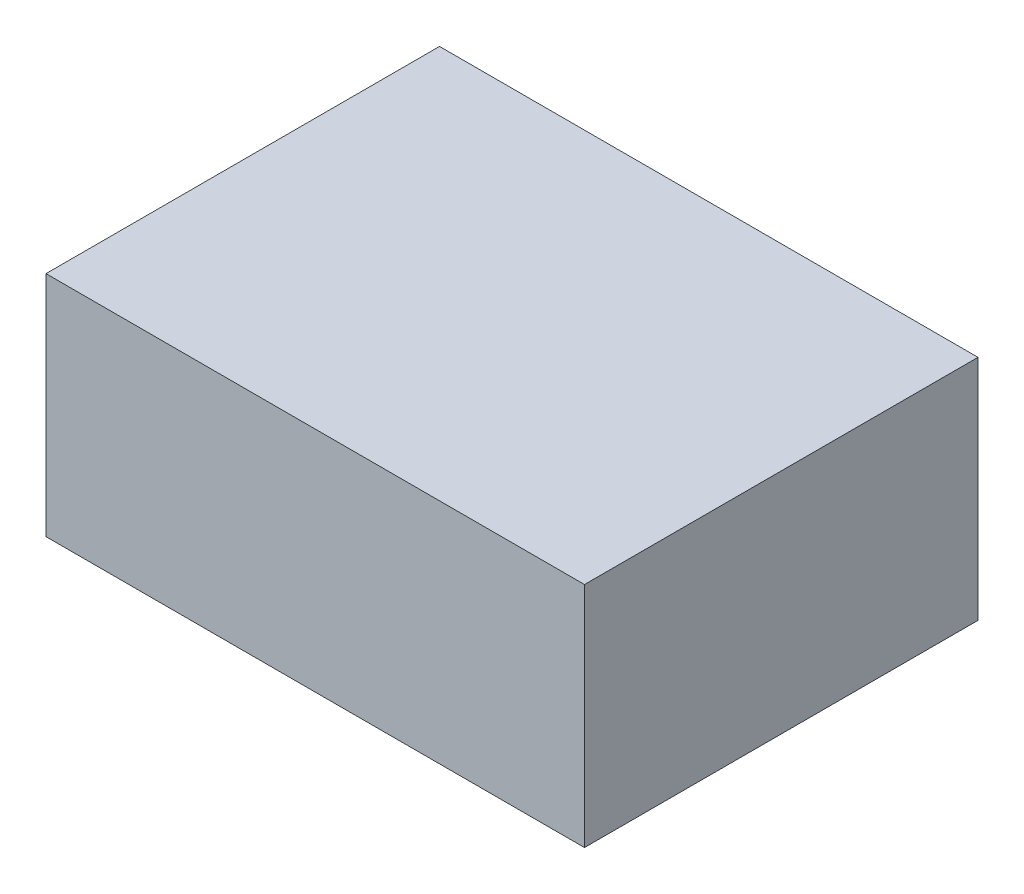
ISO-10303-21;
HEADER;
FILE_DESCRIPTION(('STEP AP214'),'2;1');
FILE_NAME('part.step','',(''),(''),'','','');
FILE_SCHEMA(('AUTOMOTIVE_DESIGN { 1 0 10303 214 1 1 1 1 }'));
ENDSEC;
DATA;
#1=APPLICATION_CONTEXT('core data for automotive mechanical design processes');
#2=APPLICATION_PROTOCOL_DEFINITION('international standard','automotive_design',2000,#1);
#3=PRODUCT_CONTEXT('',#1,'mechanical');
#4=PRODUCT('Part','Part','',(#3));
#5=PRODUCT_RELATED_PRODUCT_CATEGORY('part','',(#4));
#6=PRODUCT_DEFINITION_FORMATION('','',#4);
#7=PRODUCT_DEFINITION_CONTEXT('part definition',#1,'design');
#8=PRODUCT_DEFINITION('design','',#6,#7);
#9=PRODUCT_DEFINITION_SHAPE('','',#8);
#10=(LENGTH_UNIT() NAMED_UNIT(*) SI_UNIT(.MILLI.,.METRE.));
#11=(NAMED_UNIT(*) PLANE_ANGLE_UNIT() SI_UNIT($,.RADIAN.));
#12=(NAMED_UNIT(*) SI_UNIT($,.STERADIAN.) SOLID_ANGLE_UNIT());
#13=UNCERTAINTY_MEASURE_WITH_UNIT(LENGTH_MEASURE(1.E-05),#10,'distance_accuracy_value','');
#14=(GEOMETRIC_REPRESENTATION_CONTEXT(3) GLOBAL_UNCERTAINTY_ASSIGNED_CONTEXT((#13)) GLOBAL_UNIT_ASSIGNED_CONTEXT((#10,
#11,#12)) REPRESENTATION_CONTEXT('',''));
#15=CARTESIAN_POINT('',(0.,0.,0.));
#16=DIRECTION('',(0.,0.,1.));
#17=DIRECTION('',(1.,0.,0.));
#18=AXIS2_PLACEMENT_3D('',#15,#16,#17);
#19=CARTESIAN_POINT('',(6.4999997,-2.74999958,0.));
#20=DIRECTION('',(0.,-1.,0.));
#21=DIRECTION('',(0.,0.,-1.));
#22=AXIS2_PLACEMENT_3D('',#19,#20,#21);
#23=PLANE('',#22);
#24=DIRECTION('',(0.,0.,1.));
#25=VECTOR('',#24,1.);
#26=CARTESIAN_POINT('',(-6.4999997,-2.74999958,0.));
#27=LINE('',#26,#25);
#28=CARTESIAN_POINT('',(-6.4999997,-2.74999958,0.));
#29=VERTEX_POINT('',#28);
#30=CARTESIAN_POINT('',(-6.4999997,-2.74999958,9.49999878));
#31=VERTEX_POINT('',#30);
#32=EDGE_CURVE('E20',#29,#31,#27,.T.);
#33=ORIENTED_EDGE('',*,*,#32,.F.);
#34=DIRECTION('',(1.,0.,0.));
#35=VECTOR('',#34,1.);
#36=CARTESIAN_POINT('',(-6.4999997,-2.74999958,0.));
#37=LINE('',#36,#35);
#38=CARTESIAN_POINT('',(6.4999997,-2.74999958,0.));
#39=VERTEX_POINT('',#38);
#40=EDGE_CURVE('E80',#29,#39,#37,.T.);
#41=ORIENTED_EDGE('',*,*,#40,.T.);
#42=DIRECTION('',(0.,0.,-1.));
#43=VECTOR('',#42,1.);
#44=CARTESIAN_POINT('',(6.4999997,-2.74999958,0.));
#45=LINE('',#44,#43);
#46=CARTESIAN_POINT('',(6.4999997,-2.74999958,9.49999878));
#47=VERTEX_POINT('',#46);
#48=EDGE_CURVE('E68',#47,#39,#45,.T.);
#49=ORIENTED_EDGE('',*,*,#48,.F.);
#50=DIRECTION('',(1.,0.,0.));
#51=VECTOR('',#50,1.);
#52=CARTESIAN_POINT('',(-6.4999997,-2.74999958,9.49999878));
#53=LINE('',#52,#51);
#54=EDGE_CURVE('E56',#31,#47,#53,.T.);
#55=ORIENTED_EDGE('',*,*,#54,.F.);
#56=EDGE_LOOP('',(#33,#41,#49,#55));
#57=FACE_BOUND('',#56,.T.);
#58=ADVANCED_FACE('F17',(#57),#23,.T.);
#59=CARTESIAN_POINT('',(-6.4999997,-2.74999958,0.));
#60=DIRECTION('',(-1.,0.,0.));
#61=DIRECTION('',(0.,0.,1.));
#62=AXIS2_PLACEMENT_3D('',#59,#60,#61);
#63=PLANE('',#62);
#64=DIRECTION('',(0.,0.,1.));
#65=VECTOR('',#64,1.);
#66=CARTESIAN_POINT('',(-6.4999997,2.74999958,0.));
#67=LINE('',#66,#65);
#68=CARTESIAN_POINT('',(-6.4999997,2.74999958,0.));
#69=VERTEX_POINT('',#68);
#70=CARTESIAN_POINT('',(-6.4999997,2.74999958,9.49999878));
#71=VERTEX_POINT('',#70);
#72=EDGE_CURVE('E83',#69,#71,#67,.T.);
#73=ORIENTED_EDGE('',*,*,#72,.F.);
#74=DIRECTION('',(0.,1.,0.));
#75=VECTOR('',#74,1.);
#76=CARTESIAN_POINT('',(-6.4999997,2.74999958,0.));
#77=LINE('',#76,#75);
#78=EDGE_CURVE('E65',#69,#29,#77,.F.);
#79=ORIENTED_EDGE('',*,*,#78,.T.);
#80=ORIENTED_EDGE('',*,*,#32,.T.);
#81=DIRECTION('',(0.,1.,0.));
#82=VECTOR('',#81,1.);
#83=CARTESIAN_POINT('',(-6.4999997,2.74999958,9.49999878));
#84=LINE('',#83,#82);
#85=EDGE_CURVE('E62',#71,#31,#84,.F.);
#86=ORIENTED_EDGE('',*,*,#85,.F.);
#87=EDGE_LOOP('',(#73,#79,#80,#86));
#88=FACE_BOUND('',#87,.T.);
#89=ADVANCED_FACE('F61',(#88),#63,.T.);
#90=CARTESIAN_POINT('',(-6.4999997,2.74999958,9.49999878));
#91=DIRECTION('',(0.,0.,1.));
#92=DIRECTION('',(1.,0.,0.));
#93=AXIS2_PLACEMENT_3D('',#90,#91,#92);
#94=PLANE('',#93);
#95=DIRECTION('',(0.,1.,0.));
#96=VECTOR('',#95,1.);
#97=CARTESIAN_POINT('',(6.4999997,2.74999958,9.49999878));
#98=LINE('',#97,#96);
#99=CARTESIAN_POINT('',(6.4999997,2.74999958,9.49999878));
#100=VERTEX_POINT('',#99);
#101=EDGE_CURVE('E70',#100,#47,#98,.F.);
#102=ORIENTED_EDGE('',*,*,#101,.F.);
#103=DIRECTION('',(1.,0.,0.));
#104=VECTOR('',#103,1.);
#105=CARTESIAN_POINT('',(-6.4999997,2.74999958,9.49999878));
#106=LINE('',#105,#104);
#107=EDGE_CURVE('E74',#71,#100,#106,.T.);
#108=ORIENTED_EDGE('',*,*,#107,.F.);
#109=ORIENTED_EDGE('',*,*,#85,.T.);
#110=ORIENTED_EDGE('',*,*,#54,.T.);
#111=EDGE_LOOP('',(#102,#108,#109,#110));
#112=FACE_BOUND('',#111,.T.);
#113=ADVANCED_FACE('F72',(#112),#94,.T.);
#114=CARTESIAN_POINT('',(6.4999997,2.74999958,0.));
#115=DIRECTION('',(1.,0.,0.));
#116=DIRECTION('',(0.,0.,-1.));
#117=AXIS2_PLACEMENT_3D('',#114,#115,#116);
#118=PLANE('',#117);
#119=ORIENTED_EDGE('',*,*,#48,.T.);
#120=DIRECTION('',(0.,1.,0.));
#121=VECTOR('',#120,1.);
#122=CARTESIAN_POINT('',(6.4999997,2.74999958,0.));
#123=LINE('',#122,#121);
#124=CARTESIAN_POINT('',(6.4999997,2.74999958,0.));
#125=VERTEX_POINT('',#124);
#126=EDGE_CURVE('E35',#39,#125,#123,.T.);
#127=ORIENTED_EDGE('',*,*,#126,.T.);
#128=DIRECTION('',(0.,0.,1.));
#129=VECTOR('',#128,1.);
#130=CARTESIAN_POINT('',(6.4999997,2.74999958,0.));
#131=LINE('',#130,#129);
#132=EDGE_CURVE('E26',#100,#125,#131,.F.);
#133=ORIENTED_EDGE('',*,*,#132,.F.);
#134=ORIENTED_EDGE('',*,*,#101,.T.);
#135=EDGE_LOOP('',(#119,#127,#133,#134));
#136=FACE_BOUND('',#135,.T.);
#137=ADVANCED_FACE('F89',(#136),#118,.T.);
#138=CARTESIAN_POINT('',(-6.4999997,2.74999958,0.));
#139=DIRECTION('',(0.,0.,1.));
#140=DIRECTION('',(1.,0.,0.));
#141=AXIS2_PLACEMENT_3D('',#138,#139,#140);
#142=PLANE('',#141);
#143=ORIENTED_EDGE('',*,*,#126,.F.);
#144=ORIENTED_EDGE('',*,*,#40,.F.);
#145=ORIENTED_EDGE('',*,*,#78,.F.);
#146=DIRECTION('',(1.,0.,0.));
#147=VECTOR('',#146,1.);
#148=CARTESIAN_POINT('',(-6.4999997,2.74999958,0.));
#149=LINE('',#148,#147);
#150=EDGE_CURVE('E11',#125,#69,#149,.F.);
#151=ORIENTED_EDGE('',*,*,#150,.F.);
#152=EDGE_LOOP('',(#143,#144,#145,#151));
#153=FACE_BOUND('',#152,.T.);
#154=ADVANCED_FACE('F91',(#153),#142,.F.);
#155=CARTESIAN_POINT('',(-6.4999997,2.74999958,0.));
#156=DIRECTION('',(0.,1.,0.));
#157=DIRECTION('',(0.,0.,1.));
#158=AXIS2_PLACEMENT_3D('',#155,#156,#157);
#159=PLANE('',#158);
#160=ORIENTED_EDGE('',*,*,#132,.T.);
#161=ORIENTED_EDGE('',*,*,#150,.T.);
#162=ORIENTED_EDGE('',*,*,#72,.T.);
#163=ORIENTED_EDGE('',*,*,#107,.T.);
#164=EDGE_LOOP('',(#160,#161,#162,#163));
#165=FACE_BOUND('',#164,.T.);
#166=ADVANCED_FACE('F88',(#165),#159,.T.);
#167=CLOSED_SHELL('',(#58,#89,#113,#137,#154,#166));
#168=MANIFOLD_SOLID_BREP('B1',#167);
#169=ADVANCED_BREP_SHAPE_REPRESENTATION('',(#18,#168),#14);
#170=SHAPE_DEFINITION_REPRESENTATION(#9,#169);
ENDSEC;
END-ISO-10303-21;
